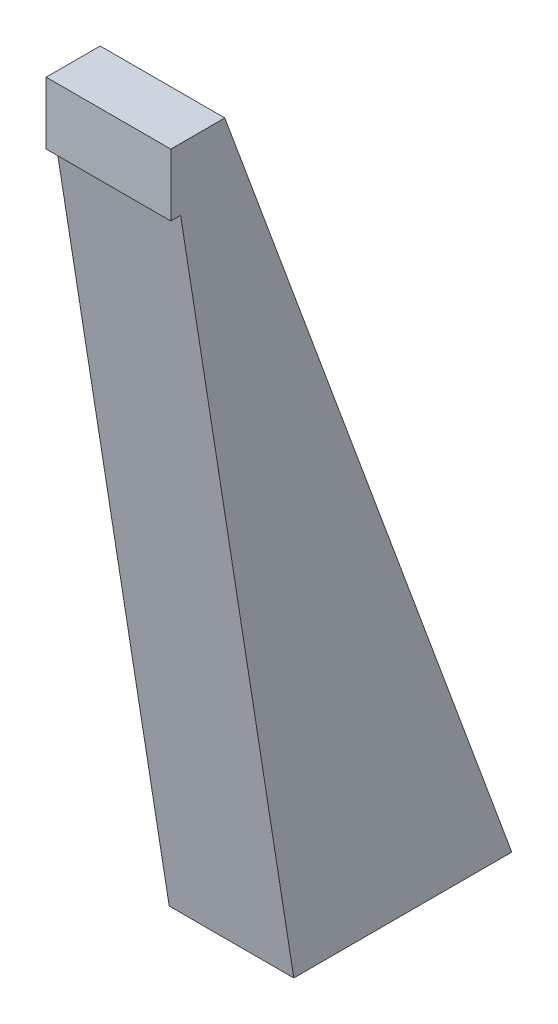
ISO-10303-21;
HEADER;
FILE_DESCRIPTION(('STEP AP214'),'2;1');
FILE_NAME('part.step','',(''),(''),'','','');
FILE_SCHEMA(('AUTOMOTIVE_DESIGN { 1 0 10303 214 1 1 1 1 }'));
ENDSEC;
DATA;
#1=APPLICATION_CONTEXT('core data for automotive mechanical design processes');
#2=APPLICATION_PROTOCOL_DEFINITION('international standard','automotive_design',2000,#1);
#3=PRODUCT_CONTEXT('',#1,'mechanical');
#4=PRODUCT('Part','Part','',(#3));
#5=PRODUCT_RELATED_PRODUCT_CATEGORY('part','',(#4));
#6=PRODUCT_DEFINITION_FORMATION('','',#4);
#7=PRODUCT_DEFINITION_CONTEXT('part definition',#1,'design');
#8=PRODUCT_DEFINITION('design','',#6,#7);
#9=PRODUCT_DEFINITION_SHAPE('','',#8);
#10=(LENGTH_UNIT() NAMED_UNIT(*) SI_UNIT(.MILLI.,.METRE.));
#11=(NAMED_UNIT(*) PLANE_ANGLE_UNIT() SI_UNIT($,.RADIAN.));
#12=(NAMED_UNIT(*) SI_UNIT($,.STERADIAN.) SOLID_ANGLE_UNIT());
#13=UNCERTAINTY_MEASURE_WITH_UNIT(LENGTH_MEASURE(1.E-05),#10,'distance_accuracy_value','');
#14=(GEOMETRIC_REPRESENTATION_CONTEXT(3) GLOBAL_UNCERTAINTY_ASSIGNED_CONTEXT((#13)) GLOBAL_UNIT_ASSIGNED_CONTEXT((#10,
#11,#12)) REPRESENTATION_CONTEXT('',''));
#15=CARTESIAN_POINT('',(0.,0.,0.));
#16=DIRECTION('',(0.,0.,1.));
#17=DIRECTION('',(1.,0.,0.));
#18=AXIS2_PLACEMENT_3D('',#15,#16,#17);
#19=CARTESIAN_POINT('',(60.,0.,-105.));
#20=DIRECTION('',(0.,1.,0.));
#21=DIRECTION('',(0.,0.,1.));
#22=AXIS2_PLACEMENT_3D('',#19,#20,#21);
#23=PLANE('',#22);
#24=DIRECTION('',(0.,0.,-1.));
#25=VECTOR('',#24,1.);
#26=CARTESIAN_POINT('',(0.,0.,-105.));
#27=LINE('',#26,#25);
#28=CARTESIAN_POINT('',(0.,0.,0.));
#29=VERTEX_POINT('',#28);
#30=CARTESIAN_POINT('',(0.,0.,-105.));
#31=VERTEX_POINT('',#30);
#32=EDGE_CURVE('E116',#29,#31,#27,.T.);
#33=ORIENTED_EDGE('',*,*,#32,.T.);
#34=DIRECTION('',(-1.,0.,0.));
#35=VECTOR('',#34,1.);
#36=CARTESIAN_POINT('',(60.,0.,-105.));
#37=LINE('',#36,#35);
#38=CARTESIAN_POINT('',(60.,0.,-105.));
#39=VERTEX_POINT('',#38);
#40=EDGE_CURVE('E11',#39,#31,#37,.T.);
#41=ORIENTED_EDGE('',*,*,#40,.F.);
#42=DIRECTION('',(0.,0.,-1.));
#43=VECTOR('',#42,1.);
#44=CARTESIAN_POINT('',(60.,0.,-105.));
#45=LINE('',#44,#43);
#46=CARTESIAN_POINT('',(60.,0.,0.));
#47=VERTEX_POINT('',#46);
#48=EDGE_CURVE('E117',#47,#39,#45,.T.);
#49=ORIENTED_EDGE('',*,*,#48,.F.);
#50=DIRECTION('',(-1.,0.,0.));
#51=VECTOR('',#50,1.);
#52=CARTESIAN_POINT('',(60.,0.,0.));
#53=LINE('',#52,#51);
#54=EDGE_CURVE('E122',#47,#29,#53,.T.);
#55=ORIENTED_EDGE('',*,*,#54,.T.);
#56=EDGE_LOOP('',(#33,#41,#49,#55));
#57=FACE_BOUND('',#56,.T.);
#58=ADVANCED_FACE('F33',(#57),#23,.F.);
#59=CARTESIAN_POINT('',(60.,375.354915046599,33.2341772151903));
#60=DIRECTION('',(0.,-0.345585443037976,0.938387287616497));
#61=DIRECTION('',(0.,-0.938387287616497,-0.345585443037976));
#62=AXIS2_PLACEMENT_3D('',#59,#60,#61);
#63=PLANE('',#62);
#64=DIRECTION('',(0.,0.938387287616497,0.345585443037976));
#65=VECTOR('',#64,1.);
#66=CARTESIAN_POINT('',(0.,375.354915046599,33.2341772151903));
#67=LINE('',#66,#65);
#68=CARTESIAN_POINT('',(0.,375.354915046599,33.2341772151903));
#69=VERTEX_POINT('',#68);
#70=EDGE_CURVE('E125',#31,#69,#67,.T.);
#71=ORIENTED_EDGE('',*,*,#70,.T.);
#72=DIRECTION('',(-1.,0.,0.));
#73=VECTOR('',#72,1.);
#74=CARTESIAN_POINT('',(60.,375.354915046599,33.2341772151903));
#75=LINE('',#74,#73);
#76=CARTESIAN_POINT('',(60.,375.354915046599,33.2341772151903));
#77=VERTEX_POINT('',#76);
#78=EDGE_CURVE('E40',#77,#69,#75,.T.);
#79=ORIENTED_EDGE('',*,*,#78,.F.);
#80=DIRECTION('',(0.,0.938387287616497,0.345585443037976));
#81=VECTOR('',#80,1.);
#82=CARTESIAN_POINT('',(60.,375.354915046599,33.2341772151903));
#83=LINE('',#82,#81);
#84=EDGE_CURVE('E79',#39,#77,#83,.T.);
#85=ORIENTED_EDGE('',*,*,#84,.F.);
#86=ORIENTED_EDGE('',*,*,#40,.T.);
#87=EDGE_LOOP('',(#71,#79,#85,#86));
#88=FACE_BOUND('',#87,.T.);
#89=ADVANCED_FACE('F147',(#88),#63,.F.);
#90=CARTESIAN_POINT('',(60.,375.354915046599,59.2341772151903));
#91=DIRECTION('',(0.,-1.,0.));
#92=DIRECTION('',(0.,0.,-1.));
#93=AXIS2_PLACEMENT_3D('',#90,#91,#92);
#94=PLANE('',#93);
#95=DIRECTION('',(0.,0.,1.));
#96=VECTOR('',#95,1.);
#97=CARTESIAN_POINT('',(0.,375.354915046599,59.2341772151903));
#98=LINE('',#97,#96);
#99=CARTESIAN_POINT('',(0.,375.354915046599,59.2341772151903));
#100=VERTEX_POINT('',#99);
#101=EDGE_CURVE('E127',#69,#100,#98,.T.);
#102=ORIENTED_EDGE('',*,*,#101,.T.);
#103=DIRECTION('',(-1.,0.,0.));
#104=VECTOR('',#103,1.);
#105=CARTESIAN_POINT('',(60.,375.354915046599,59.2341772151903));
#106=LINE('',#105,#104);
#107=CARTESIAN_POINT('',(60.,375.354915046599,59.2341772151903));
#108=VERTEX_POINT('',#107);
#109=EDGE_CURVE('E131',#108,#100,#106,.T.);
#110=ORIENTED_EDGE('',*,*,#109,.F.);
#111=DIRECTION('',(0.,0.,1.));
#112=VECTOR('',#111,1.);
#113=CARTESIAN_POINT('',(60.,375.354915046599,59.2341772151903));
#114=LINE('',#113,#112);
#115=EDGE_CURVE('E108',#77,#108,#114,.T.);
#116=ORIENTED_EDGE('',*,*,#115,.F.);
#117=ORIENTED_EDGE('',*,*,#78,.T.);
#118=EDGE_LOOP('',(#102,#110,#116,#117));
#119=FACE_BOUND('',#118,.T.);
#120=ADVANCED_FACE('F135',(#119),#94,.F.);
#121=CARTESIAN_POINT('',(60.,0.,0.));
#122=DIRECTION('',(0.,0.155879413724185,-0.987776092227892));
#123=DIRECTION('',(0.,0.987776092227892,0.155879413724185));
#124=AXIS2_PLACEMENT_3D('',#121,#122,#123);
#125=PLANE('',#124);
#126=DIRECTION('',(0.,-0.987776092227892,-0.155879413724185));
#127=VECTOR('',#126,1.);
#128=CARTESIAN_POINT('',(60.,0.,0.));
#129=LINE('',#128,#127);
#130=CARTESIAN_POINT('',(60.,345.354915046599,54.4999237254363));
#131=VERTEX_POINT('',#130);
#132=EDGE_CURVE('E47',#131,#47,#129,.T.);
#133=ORIENTED_EDGE('',*,*,#132,.F.);
#134=DIRECTION('',(-1.,0.,0.));
#135=VECTOR('',#134,1.);
#136=CARTESIAN_POINT('',(60.,345.354915046599,54.4999237254363));
#137=LINE('',#136,#135);
#138=CARTESIAN_POINT('',(0.,345.354915046599,54.4999237254363));
#139=VERTEX_POINT('',#138);
#140=EDGE_CURVE('E95',#131,#139,#137,.T.);
#141=ORIENTED_EDGE('',*,*,#140,.T.);
#142=DIRECTION('',(0.,-0.987776092227892,-0.155879413724185));
#143=VECTOR('',#142,1.);
#144=CARTESIAN_POINT('',(0.,0.,0.));
#145=LINE('',#144,#143);
#146=EDGE_CURVE('E72',#139,#29,#145,.T.);
#147=ORIENTED_EDGE('',*,*,#146,.T.);
#148=ORIENTED_EDGE('',*,*,#54,.F.);
#149=EDGE_LOOP('',(#133,#141,#147,#148));
#150=FACE_BOUND('',#149,.T.);
#151=ADVANCED_FACE('F139',(#150),#125,.F.);
#152=CARTESIAN_POINT('',(60.,0.,0.));
#153=DIRECTION('',(-1.,0.,0.));
#154=DIRECTION('',(0.,0.,1.));
#155=AXIS2_PLACEMENT_3D('',#152,#153,#154);
#156=PLANE('',#155);
#157=ORIENTED_EDGE('',*,*,#84,.T.);
#158=ORIENTED_EDGE('',*,*,#115,.T.);
#159=DIRECTION('',(0.,1.,0.));
#160=VECTOR('',#159,1.);
#161=CARTESIAN_POINT('',(60.,375.354915046599,59.2341772151903));
#162=LINE('',#161,#160);
#163=CARTESIAN_POINT('',(60.,345.354915046599,59.2341772151903));
#164=VERTEX_POINT('',#163);
#165=EDGE_CURVE('E97',#164,#108,#162,.T.);
#166=ORIENTED_EDGE('',*,*,#165,.F.);
#167=DIRECTION('',(0.,0.,1.));
#168=VECTOR('',#167,1.);
#169=CARTESIAN_POINT('',(60.,345.354915046599,33.2341772151903));
#170=LINE('',#169,#168);
#171=EDGE_CURVE('E89',#131,#164,#170,.T.);
#172=ORIENTED_EDGE('',*,*,#171,.F.);
#173=ORIENTED_EDGE('',*,*,#132,.T.);
#174=ORIENTED_EDGE('',*,*,#48,.T.);
#175=EDGE_LOOP('',(#157,#158,#166,#172,#173,#174));
#176=FACE_BOUND('',#175,.T.);
#177=ADVANCED_FACE('F106',(#176),#156,.F.);
#178=CARTESIAN_POINT('',(0.,0.,0.));
#179=DIRECTION('',(-1.,0.,0.));
#180=DIRECTION('',(0.,0.,1.));
#181=AXIS2_PLACEMENT_3D('',#178,#179,#180);
#182=PLANE('',#181);
#183=ORIENTED_EDGE('',*,*,#101,.F.);
#184=ORIENTED_EDGE('',*,*,#70,.F.);
#185=ORIENTED_EDGE('',*,*,#32,.F.);
#186=ORIENTED_EDGE('',*,*,#146,.F.);
#187=DIRECTION('',(0.,0.,1.));
#188=VECTOR('',#187,1.);
#189=CARTESIAN_POINT('',(0.,345.354915046599,33.2341772151903));
#190=LINE('',#189,#188);
#191=CARTESIAN_POINT('',(0.,345.354915046599,59.2341772151903));
#192=VERTEX_POINT('',#191);
#193=EDGE_CURVE('E112',#139,#192,#190,.T.);
#194=ORIENTED_EDGE('',*,*,#193,.T.);
#195=DIRECTION('',(0.,1.,0.));
#196=VECTOR('',#195,1.);
#197=CARTESIAN_POINT('',(0.,375.354915046599,59.2341772151903));
#198=LINE('',#197,#196);
#199=EDGE_CURVE('E98',#192,#100,#198,.T.);
#200=ORIENTED_EDGE('',*,*,#199,.T.);
#201=EDGE_LOOP('',(#183,#184,#185,#186,#194,#200));
#202=FACE_BOUND('',#201,.T.);
#203=ADVANCED_FACE('F137',(#202),#182,.T.);
#204=CARTESIAN_POINT('',(60.,345.354915046599,33.2341772151903));
#205=DIRECTION('',(0.,-1.,0.));
#206=DIRECTION('',(0.,0.,-1.));
#207=AXIS2_PLACEMENT_3D('',#204,#205,#206);
#208=PLANE('',#207);
#209=ORIENTED_EDGE('',*,*,#140,.F.);
#210=ORIENTED_EDGE('',*,*,#171,.T.);
#211=DIRECTION('',(-1.,0.,0.));
#212=VECTOR('',#211,1.);
#213=CARTESIAN_POINT('',(60.,345.354915046599,59.2341772151903));
#214=LINE('',#213,#212);
#215=EDGE_CURVE('E93',#164,#192,#214,.T.);
#216=ORIENTED_EDGE('',*,*,#215,.T.);
#217=ORIENTED_EDGE('',*,*,#193,.F.);
#218=EDGE_LOOP('',(#209,#210,#216,#217));
#219=FACE_BOUND('',#218,.T.);
#220=ADVANCED_FACE('F91',(#219),#208,.T.);
#221=CARTESIAN_POINT('',(60.,375.354915046599,59.2341772151903));
#222=DIRECTION('',(0.,0.,1.));
#223=DIRECTION('',(0.,-1.,0.));
#224=AXIS2_PLACEMENT_3D('',#221,#222,#223);
#225=PLANE('',#224);
#226=ORIENTED_EDGE('',*,*,#199,.F.);
#227=ORIENTED_EDGE('',*,*,#215,.F.);
#228=ORIENTED_EDGE('',*,*,#165,.T.);
#229=ORIENTED_EDGE('',*,*,#109,.T.);
#230=EDGE_LOOP('',(#226,#227,#228,#229));
#231=FACE_BOUND('',#230,.T.);
#232=ADVANCED_FACE('F102',(#231),#225,.T.);
#233=CLOSED_SHELL('',(#58,#89,#120,#151,#177,#203,#220,#232));
#234=MANIFOLD_SOLID_BREP('B2',#233);
#235=ADVANCED_BREP_SHAPE_REPRESENTATION('',(#18,#234),#14);
#236=SHAPE_DEFINITION_REPRESENTATION(#9,#235);
ENDSEC;
END-ISO-10303-21;
